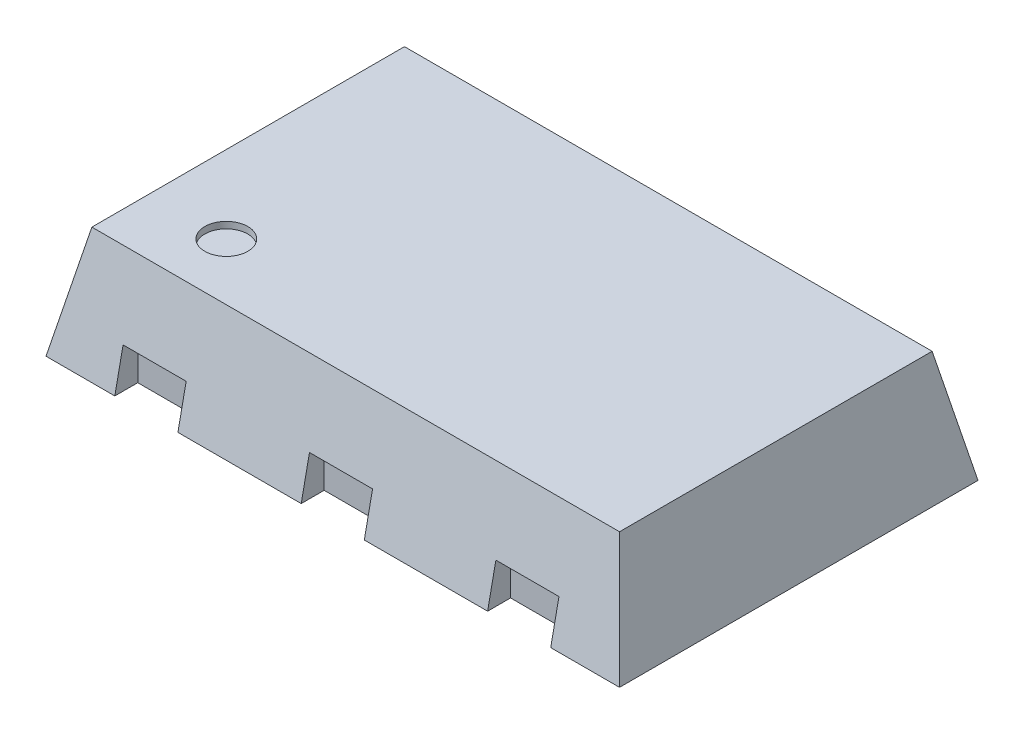
ISO-10303-21;
HEADER;
FILE_DESCRIPTION(('STEP AP214'),'2;1');
FILE_NAME('part.step','',(''),(''),'','','');
FILE_SCHEMA(('AUTOMOTIVE_DESIGN { 1 0 10303 214 1 1 1 1 }'));
ENDSEC;
DATA;
#1=APPLICATION_CONTEXT('core data for automotive mechanical design processes');
#2=APPLICATION_PROTOCOL_DEFINITION('international standard','automotive_design',2000,#1);
#3=PRODUCT_CONTEXT('',#1,'mechanical');
#4=PRODUCT('Part','Part','',(#3));
#5=PRODUCT_RELATED_PRODUCT_CATEGORY('part','',(#4));
#6=PRODUCT_DEFINITION_FORMATION('','',#4);
#7=PRODUCT_DEFINITION_CONTEXT('part definition',#1,'design');
#8=PRODUCT_DEFINITION('design','',#6,#7);
#9=PRODUCT_DEFINITION_SHAPE('','',#8);
#10=(LENGTH_UNIT() NAMED_UNIT(*) SI_UNIT(.MILLI.,.METRE.));
#11=(NAMED_UNIT(*) PLANE_ANGLE_UNIT() SI_UNIT($,.RADIAN.));
#12=(NAMED_UNIT(*) SI_UNIT($,.STERADIAN.) SOLID_ANGLE_UNIT());
#13=UNCERTAINTY_MEASURE_WITH_UNIT(LENGTH_MEASURE(1.E-05),#10,'distance_accuracy_value','');
#14=(GEOMETRIC_REPRESENTATION_CONTEXT(3) GLOBAL_UNCERTAINTY_ASSIGNED_CONTEXT((#13)) GLOBAL_UNIT_ASSIGNED_CONTEXT((#10,
#11,#12)) REPRESENTATION_CONTEXT('',''));
#15=CARTESIAN_POINT('',(0.,0.,0.));
#16=DIRECTION('',(0.,0.,1.));
#17=DIRECTION('',(1.,0.,0.));
#18=AXIS2_PLACEMENT_3D('',#15,#16,#17);
#19=CARTESIAN_POINT('',(0.,0.09500000000001,0.));
#20=DIRECTION('',(0.,1.,0.));
#21=DIRECTION('',(0.,0.,-1.));
#22=AXIS2_PLACEMENT_3D('',#19,#20,#21);
#23=PLANE('',#22);
#24=DIRECTION('',(-1.,0.,0.));
#25=VECTOR('',#24,1.);
#26=CARTESIAN_POINT('',(0.,0.09500000000001,-0.545));
#27=LINE('',#26,#25);
#28=CARTESIAN_POINT('',(0.76,0.095,-0.545));
#29=VERTEX_POINT('',#28);
#30=CARTESIAN_POINT('',(0.54,0.095,-0.545));
#31=VERTEX_POINT('',#30);
#32=EDGE_CURVE('E314',#29,#31,#27,.T.);
#33=ORIENTED_EDGE('',*,*,#32,.F.);
#34=DIRECTION('',(0.,0.,1.));
#35=VECTOR('',#34,1.);
#36=CARTESIAN_POINT('',(0.76,0.09500000000001,0.));
#37=LINE('',#36,#35);
#38=CARTESIAN_POINT('',(0.76,0.095,-0.625));
#39=VERTEX_POINT('',#38);
#40=EDGE_CURVE('E501',#39,#29,#37,.T.);
#41=ORIENTED_EDGE('',*,*,#40,.F.);
#42=DIRECTION('',(-1.,0.,0.));
#43=VECTOR('',#42,1.);
#44=CARTESIAN_POINT('',(0.,0.09500000000001,-0.625));
#45=LINE('',#44,#43);
#46=CARTESIAN_POINT('',(1.,0.09500000000001,-0.625));
#47=VERTEX_POINT('',#46);
#48=EDGE_CURVE('E332',#47,#39,#45,.T.);
#49=ORIENTED_EDGE('',*,*,#48,.F.);
#50=DIRECTION('',(0.,0.,-1.));
#51=VECTOR('',#50,1.);
#52=CARTESIAN_POINT('',(1.,0.09500000000001,0.));
#53=LINE('',#52,#51);
#54=CARTESIAN_POINT('',(1.,0.09500000000001,0.625));
#55=VERTEX_POINT('',#54);
#56=EDGE_CURVE('E291',#55,#47,#53,.T.);
#57=ORIENTED_EDGE('',*,*,#56,.F.);
#58=DIRECTION('',(-1.,0.,0.));
#59=VECTOR('',#58,1.);
#60=CARTESIAN_POINT('',(0.,0.09500000000001,0.625));
#61=LINE('',#60,#59);
#62=CARTESIAN_POINT('',(0.76,0.095,0.625));
#63=VERTEX_POINT('',#62);
#64=EDGE_CURVE('E319',#55,#63,#61,.T.);
#65=ORIENTED_EDGE('',*,*,#64,.T.);
#66=DIRECTION('',(0.,0.,1.));
#67=VECTOR('',#66,1.);
#68=CARTESIAN_POINT('',(0.76,0.09500000000001,0.));
#69=LINE('',#68,#67);
#70=CARTESIAN_POINT('',(0.76,0.095,0.545));
#71=VERTEX_POINT('',#70);
#72=EDGE_CURVE('E305',#71,#63,#69,.T.);
#73=ORIENTED_EDGE('',*,*,#72,.F.);
#74=DIRECTION('',(1.,0.,0.));
#75=VECTOR('',#74,1.);
#76=CARTESIAN_POINT('',(0.,0.09500000000001,0.545));
#77=LINE('',#76,#75);
#78=CARTESIAN_POINT('',(0.54,0.095,0.545));
#79=VERTEX_POINT('',#78);
#80=EDGE_CURVE('E419',#79,#71,#77,.T.);
#81=ORIENTED_EDGE('',*,*,#80,.F.);
#82=DIRECTION('',(0.,0.,-1.));
#83=VECTOR('',#82,1.);
#84=CARTESIAN_POINT('',(0.54,0.09500000000001,0.));
#85=LINE('',#84,#83);
#86=CARTESIAN_POINT('',(0.54,0.09500000000001,0.625));
#87=VERTEX_POINT('',#86);
#88=EDGE_CURVE('E325',#87,#79,#85,.T.);
#89=ORIENTED_EDGE('',*,*,#88,.F.);
#90=DIRECTION('',(-1.,0.,0.));
#91=VECTOR('',#90,1.);
#92=CARTESIAN_POINT('',(0.,0.09500000000001,0.625));
#93=LINE('',#92,#91);
#94=CARTESIAN_POINT('',(0.11,0.095,0.625));
#95=VERTEX_POINT('',#94);
#96=EDGE_CURVE('E285',#87,#95,#93,.T.);
#97=ORIENTED_EDGE('',*,*,#96,.T.);
#98=DIRECTION('',(0.,0.,1.));
#99=VECTOR('',#98,1.);
#100=CARTESIAN_POINT('',(0.11,0.09500000000001,0.));
#101=LINE('',#100,#99);
#102=CARTESIAN_POINT('',(0.11,0.095,0.545));
#103=VERTEX_POINT('',#102);
#104=EDGE_CURVE('E329',#103,#95,#101,.T.);
#105=ORIENTED_EDGE('',*,*,#104,.F.);
#106=DIRECTION('',(1.,0.,0.));
#107=VECTOR('',#106,1.);
#108=CARTESIAN_POINT('',(0.,0.09500000000001,0.545));
#109=LINE('',#108,#107);
#110=CARTESIAN_POINT('',(-0.11,0.095,0.545));
#111=VERTEX_POINT('',#110);
#112=EDGE_CURVE('E341',#111,#103,#109,.T.);
#113=ORIENTED_EDGE('',*,*,#112,.F.);
#114=DIRECTION('',(0.,0.,-1.));
#115=VECTOR('',#114,1.);
#116=CARTESIAN_POINT('',(-0.11,0.09500000000001,0.));
#117=LINE('',#116,#115);
#118=CARTESIAN_POINT('',(-0.11,0.09500000000001,0.625));
#119=VERTEX_POINT('',#118);
#120=EDGE_CURVE('E451',#119,#111,#117,.T.);
#121=ORIENTED_EDGE('',*,*,#120,.F.);
#122=DIRECTION('',(-1.,0.,0.));
#123=VECTOR('',#122,1.);
#124=CARTESIAN_POINT('',(0.,0.09500000000001,0.625));
#125=LINE('',#124,#123);
#126=CARTESIAN_POINT('',(-0.54,0.095,0.625));
#127=VERTEX_POINT('',#126);
#128=EDGE_CURVE('E381',#119,#127,#125,.T.);
#129=ORIENTED_EDGE('',*,*,#128,.T.);
#130=DIRECTION('',(0.,0.,1.));
#131=VECTOR('',#130,1.);
#132=CARTESIAN_POINT('',(-0.54,0.09500000000001,0.));
#133=LINE('',#132,#131);
#134=CARTESIAN_POINT('',(-0.54,0.095,0.545));
#135=VERTEX_POINT('',#134);
#136=EDGE_CURVE('E455',#135,#127,#133,.T.);
#137=ORIENTED_EDGE('',*,*,#136,.F.);
#138=DIRECTION('',(1.,0.,0.));
#139=VECTOR('',#138,1.);
#140=CARTESIAN_POINT('',(0.,0.09500000000001,0.545));
#141=LINE('',#140,#139);
#142=CARTESIAN_POINT('',(-0.76,0.095,0.545));
#143=VERTEX_POINT('',#142);
#144=EDGE_CURVE('E202',#143,#135,#141,.T.);
#145=ORIENTED_EDGE('',*,*,#144,.F.);
#146=DIRECTION('',(0.,0.,-1.));
#147=VECTOR('',#146,1.);
#148=CARTESIAN_POINT('',(-0.76,0.09500000000001,0.));
#149=LINE('',#148,#147);
#150=CARTESIAN_POINT('',(-0.76,0.09500000000001,0.625));
#151=VERTEX_POINT('',#150);
#152=EDGE_CURVE('E259',#151,#143,#149,.T.);
#153=ORIENTED_EDGE('',*,*,#152,.F.);
#154=DIRECTION('',(-1.,0.,0.));
#155=VECTOR('',#154,1.);
#156=CARTESIAN_POINT('',(0.,0.09500000000001,0.625));
#157=LINE('',#156,#155);
#158=CARTESIAN_POINT('',(-1.,0.09500000000001,0.625));
#159=VERTEX_POINT('',#158);
#160=EDGE_CURVE('E347',#151,#159,#157,.T.);
#161=ORIENTED_EDGE('',*,*,#160,.T.);
#162=DIRECTION('',(0.,0.,1.));
#163=VECTOR('',#162,1.);
#164=CARTESIAN_POINT('',(-1.,0.09500000000001,0.));
#165=LINE('',#164,#163);
#166=CARTESIAN_POINT('',(-1.,0.09500000000001,-0.625));
#167=VERTEX_POINT('',#166);
#168=EDGE_CURVE('E407',#167,#159,#165,.T.);
#169=ORIENTED_EDGE('',*,*,#168,.F.);
#170=DIRECTION('',(-1.,0.,0.));
#171=VECTOR('',#170,1.);
#172=CARTESIAN_POINT('',(0.,0.09500000000001,-0.625));
#173=LINE('',#172,#171);
#174=CARTESIAN_POINT('',(-0.76,0.095,-0.625));
#175=VERTEX_POINT('',#174);
#176=EDGE_CURVE('E214',#175,#167,#173,.T.);
#177=ORIENTED_EDGE('',*,*,#176,.F.);
#178=DIRECTION('',(0.,0.,-1.));
#179=VECTOR('',#178,1.);
#180=CARTESIAN_POINT('',(-0.76,0.09500000000001,0.));
#181=LINE('',#180,#179);
#182=CARTESIAN_POINT('',(-0.76,0.095,-0.545));
#183=VERTEX_POINT('',#182);
#184=EDGE_CURVE('E368',#183,#175,#181,.T.);
#185=ORIENTED_EDGE('',*,*,#184,.F.);
#186=DIRECTION('',(-1.,0.,0.));
#187=VECTOR('',#186,1.);
#188=CARTESIAN_POINT('',(0.,0.09500000000001,-0.545));
#189=LINE('',#188,#187);
#190=CARTESIAN_POINT('',(-0.54,0.095,-0.545));
#191=VERTEX_POINT('',#190);
#192=EDGE_CURVE('E373',#191,#183,#189,.T.);
#193=ORIENTED_EDGE('',*,*,#192,.F.);
#194=DIRECTION('',(0.,0.,1.));
#195=VECTOR('',#194,1.);
#196=CARTESIAN_POINT('',(-0.54,0.09500000000001,0.));
#197=LINE('',#196,#195);
#198=CARTESIAN_POINT('',(-0.54,0.095,-0.625));
#199=VERTEX_POINT('',#198);
#200=EDGE_CURVE('E309',#199,#191,#197,.T.);
#201=ORIENTED_EDGE('',*,*,#200,.F.);
#202=DIRECTION('',(-1.,0.,0.));
#203=VECTOR('',#202,1.);
#204=CARTESIAN_POINT('',(0.,0.09500000000001,-0.625));
#205=LINE('',#204,#203);
#206=CARTESIAN_POINT('',(0.54,0.095,-0.625));
#207=VERTEX_POINT('',#206);
#208=EDGE_CURVE('E295',#207,#199,#205,.T.);
#209=ORIENTED_EDGE('',*,*,#208,.F.);
#210=DIRECTION('',(0.,0.,-1.));
#211=VECTOR('',#210,1.);
#212=CARTESIAN_POINT('',(0.54,0.09500000000001,0.));
#213=LINE('',#212,#211);
#214=EDGE_CURVE('E11',#31,#207,#213,.T.);
#215=ORIENTED_EDGE('',*,*,#214,.F.);
#216=EDGE_LOOP('',(#33,#41,#49,#57,#65,#73,#81,#89,#97,#105,#113,#121,#129,#137,#145,#153,#161,
#169,#177,#185,#193,#201,#209,#215));
#217=FACE_BOUND('',#216,.T.);
#218=ADVANCED_FACE('F16',(#217),#23,.F.);
#219=CARTESIAN_POINT('',(0.54,-0.121132572617,-0.825365755119));
#220=DIRECTION('',(1.,0.,0.));
#221=DIRECTION('',(0.,-1.,0.));
#222=AXIS2_PLACEMENT_3D('',#219,#220,#221);
#223=PLANE('',#222);
#224=DIRECTION('',(0.,-1.,0.));
#225=VECTOR('',#224,1.);
#226=CARTESIAN_POINT('',(0.54,-0.121132572617,-0.545));
#227=LINE('',#226,#225);
#228=CARTESIAN_POINT('',(0.54,0.235,-0.545));
#229=VERTEX_POINT('',#228);
#230=EDGE_CURVE('E27',#229,#31,#227,.T.);
#231=ORIENTED_EDGE('',*,*,#230,.T.);
#232=ORIENTED_EDGE('',*,*,#214,.T.);
#233=DIRECTION('',(0.,0.979602700641535,0.20094414372111));
#234=VECTOR('',#233,1.);
#235=CARTESIAN_POINT('',(0.54,0.095,-0.625));
#236=LINE('',#235,#234);
#237=CARTESIAN_POINT('',(0.54,0.235,-0.596282051282));
#238=VERTEX_POINT('',#237);
#239=EDGE_CURVE('E505',#207,#238,#236,.T.);
#240=ORIENTED_EDGE('',*,*,#239,.T.);
#241=DIRECTION('',(0.,0.,1.));
#242=VECTOR('',#241,1.);
#243=CARTESIAN_POINT('',(0.54,0.235,-0.825365755119));
#244=LINE('',#243,#242);
#245=EDGE_CURVE('E310',#238,#229,#244,.T.);
#246=ORIENTED_EDGE('',*,*,#245,.T.);
#247=EDGE_LOOP('',(#231,#232,#240,#246));
#248=FACE_BOUND('',#247,.T.);
#249=ADVANCED_FACE('F860',(#248),#223,.T.);
#250=CARTESIAN_POINT('',(0.54,0.095,-0.545));
#251=DIRECTION('',(0.,0.,1.));
#252=DIRECTION('',(0.,-1.,0.));
#253=AXIS2_PLACEMENT_3D('',#250,#251,#252);
#254=PLANE('',#253);
#255=ORIENTED_EDGE('',*,*,#32,.T.);
#256=ORIENTED_EDGE('',*,*,#230,.F.);
#257=DIRECTION('',(-1.,0.,0.));
#258=VECTOR('',#257,1.);
#259=CARTESIAN_POINT('',(0.54,0.235,-0.545));
#260=LINE('',#259,#258);
#261=CARTESIAN_POINT('',(0.76,0.235,-0.545));
#262=VERTEX_POINT('',#261);
#263=EDGE_CURVE('E360',#262,#229,#260,.T.);
#264=ORIENTED_EDGE('',*,*,#263,.F.);
#265=DIRECTION('',(0.,1.,0.));
#266=VECTOR('',#265,1.);
#267=CARTESIAN_POINT('',(0.76,0.095,-0.545));
#268=LINE('',#267,#266);
#269=EDGE_CURVE('E318',#29,#262,#268,.T.);
#270=ORIENTED_EDGE('',*,*,#269,.F.);
#271=EDGE_LOOP('',(#255,#256,#264,#270));
#272=FACE_BOUND('',#271,.T.);
#273=ADVANCED_FACE('F865',(#272),#254,.F.);
#274=CARTESIAN_POINT('',(0.76,0.165,-0.545));
#275=DIRECTION('',(1.,0.,0.));
#276=DIRECTION('',(0.,1.,0.));
#277=AXIS2_PLACEMENT_3D('',#274,#275,#276);
#278=PLANE('',#277);
#279=ORIENTED_EDGE('',*,*,#40,.T.);
#280=ORIENTED_EDGE('',*,*,#269,.T.);
#281=DIRECTION('',(0.,0.,1.));
#282=VECTOR('',#281,1.);
#283=CARTESIAN_POINT('',(0.76,0.235,-0.545));
#284=LINE('',#283,#282);
#285=CARTESIAN_POINT('',(0.76,0.235,-0.596282051282));
#286=VERTEX_POINT('',#285);
#287=EDGE_CURVE('E364',#286,#262,#284,.T.);
#288=ORIENTED_EDGE('',*,*,#287,.F.);
#289=DIRECTION('',(0.,0.979602700641535,0.20094414372111));
#290=VECTOR('',#289,1.);
#291=CARTESIAN_POINT('',(0.76,0.095,-0.625));
#292=LINE('',#291,#290);
#293=EDGE_CURVE('E235',#39,#286,#292,.T.);
#294=ORIENTED_EDGE('',*,*,#293,.F.);
#295=EDGE_LOOP('',(#279,#280,#288,#294));
#296=FACE_BOUND('',#295,.T.);
#297=ADVANCED_FACE('F557',(#296),#278,.F.);
#298=CARTESIAN_POINT('',(0.,0.29,-0.585));
#299=DIRECTION('',(0.,-0.20094414372111,0.979602700641535));
#300=DIRECTION('',(-1.,0.,0.));
#301=AXIS2_PLACEMENT_3D('',#298,#299,#300);
#302=PLANE('',#301);
#303=ORIENTED_EDGE('',*,*,#208,.T.);
#304=DIRECTION('',(0.,-0.979602700641535,-0.20094414372111));
#305=VECTOR('',#304,1.);
#306=CARTESIAN_POINT('',(-0.54,0.29,-0.585));
#307=LINE('',#306,#305);
#308=CARTESIAN_POINT('',(-0.54,0.235,-0.596282051282));
#309=VERTEX_POINT('',#308);
#310=EDGE_CURVE('E369',#309,#199,#307,.T.);
#311=ORIENTED_EDGE('',*,*,#310,.F.);
#312=DIRECTION('',(1.,0.,0.));
#313=VECTOR('',#312,1.);
#314=CARTESIAN_POINT('',(0.,0.235,-0.596282051282));
#315=LINE('',#314,#313);
#316=CARTESIAN_POINT('',(-0.76,0.235,-0.596282051282));
#317=VERTEX_POINT('',#316);
#318=EDGE_CURVE('E466',#317,#309,#315,.T.);
#319=ORIENTED_EDGE('',*,*,#318,.F.);
#320=DIRECTION('',(0.,0.979602700641535,0.20094414372111));
#321=VECTOR('',#320,1.);
#322=CARTESIAN_POINT('',(-0.76,0.29,-0.585));
#323=LINE('',#322,#321);
#324=EDGE_CURVE('E226',#175,#317,#323,.T.);
#325=ORIENTED_EDGE('',*,*,#324,.F.);
#326=ORIENTED_EDGE('',*,*,#176,.T.);
#327=DIRECTION('',(-0.197006093430975,-0.96040470547688,-0.197006093430975));
#328=VECTOR('',#327,1.);
#329=CARTESIAN_POINT('',(-0.92,0.485,-0.545));
#330=LINE('',#329,#328);
#331=CARTESIAN_POINT('',(-0.92,0.485,-0.545));
#332=VERTEX_POINT('',#331);
#333=EDGE_CURVE('E367',#332,#167,#330,.T.);
#334=ORIENTED_EDGE('',*,*,#333,.F.);
#335=DIRECTION('',(-1.,0.,0.));
#336=VECTOR('',#335,1.);
#337=CARTESIAN_POINT('',(0.,0.485,-0.545));
#338=LINE('',#337,#336);
#339=CARTESIAN_POINT('',(0.92,0.485,-0.545));
#340=VERTEX_POINT('',#339);
#341=EDGE_CURVE('E418',#340,#332,#338,.T.);
#342=ORIENTED_EDGE('',*,*,#341,.F.);
#343=DIRECTION('',(-0.197006093430975,0.96040470547688,0.197006093430975));
#344=VECTOR('',#343,1.);
#345=CARTESIAN_POINT('',(1.,0.09500000000001,-0.625));
#346=LINE('',#345,#344);
#347=EDGE_CURVE('E296',#47,#340,#346,.T.);
#348=ORIENTED_EDGE('',*,*,#347,.F.);
#349=ORIENTED_EDGE('',*,*,#48,.T.);
#350=ORIENTED_EDGE('',*,*,#293,.T.);
#351=DIRECTION('',(1.,0.,0.));
#352=VECTOR('',#351,1.);
#353=CARTESIAN_POINT('',(0.,0.235,-0.596282051282));
#354=LINE('',#353,#352);
#355=EDGE_CURVE('E306',#238,#286,#354,.T.);
#356=ORIENTED_EDGE('',*,*,#355,.F.);
#357=ORIENTED_EDGE('',*,*,#239,.F.);
#358=EDGE_LOOP('',(#303,#311,#319,#325,#326,#334,#342,#348,#349,#350,#356,#357));
#359=FACE_BOUND('',#358,.T.);
#360=ADVANCED_FACE('F545',(#359),#302,.F.);
#361=CARTESIAN_POINT('',(0.96,0.29,0.));
#362=DIRECTION('',(-0.979602700641535,-0.20094414372111,0.));
#363=DIRECTION('',(-0.20094414372111,0.979602700641535,0.));
#364=AXIS2_PLACEMENT_3D('',#361,#362,#363);
#365=PLANE('',#364);
#366=ORIENTED_EDGE('',*,*,#347,.T.);
#367=DIRECTION('',(0.,0.,-1.));
#368=VECTOR('',#367,1.);
#369=CARTESIAN_POINT('',(0.92,0.485,0.));
#370=LINE('',#369,#368);
#371=CARTESIAN_POINT('',(0.92,0.485,0.545));
#372=VERTEX_POINT('',#371);
#373=EDGE_CURVE('E434',#372,#340,#370,.T.);
#374=ORIENTED_EDGE('',*,*,#373,.F.);
#375=DIRECTION('',(0.197006093430975,-0.96040470547688,0.197006093430975));
#376=VECTOR('',#375,1.);
#377=CARTESIAN_POINT('',(0.92,0.485,0.545));
#378=LINE('',#377,#376);
#379=EDGE_CURVE('E323',#372,#55,#378,.T.);
#380=ORIENTED_EDGE('',*,*,#379,.T.);
#381=ORIENTED_EDGE('',*,*,#56,.T.);
#382=EDGE_LOOP('',(#366,#374,#380,#381));
#383=FACE_BOUND('',#382,.T.);
#384=ADVANCED_FACE('F551',(#383),#365,.F.);
#385=CARTESIAN_POINT('',(0.76,0.165,0.545));
#386=DIRECTION('',(-1.,0.,0.));
#387=DIRECTION('',(0.,0.,1.));
#388=AXIS2_PLACEMENT_3D('',#385,#386,#387);
#389=PLANE('',#388);
#390=DIRECTION('',(0.,-1.,0.));
#391=VECTOR('',#390,1.);
#392=CARTESIAN_POINT('',(0.76,0.165,0.545));
#393=LINE('',#392,#391);
#394=CARTESIAN_POINT('',(0.76,0.235,0.545));
#395=VERTEX_POINT('',#394);
#396=EDGE_CURVE('E403',#395,#71,#393,.T.);
#397=ORIENTED_EDGE('',*,*,#396,.T.);
#398=ORIENTED_EDGE('',*,*,#72,.T.);
#399=DIRECTION('',(0.,0.979602700641535,-0.20094414372111));
#400=VECTOR('',#399,1.);
#401=CARTESIAN_POINT('',(0.76,0.29,0.585));
#402=LINE('',#401,#400);
#403=CARTESIAN_POINT('',(0.76,0.235,0.596282051282));
#404=VERTEX_POINT('',#403);
#405=EDGE_CURVE('E324',#63,#404,#402,.T.);
#406=ORIENTED_EDGE('',*,*,#405,.T.);
#407=DIRECTION('',(0.,0.,-1.));
#408=VECTOR('',#407,1.);
#409=CARTESIAN_POINT('',(0.76,0.235,0.545));
#410=LINE('',#409,#408);
#411=EDGE_CURVE('E301',#404,#395,#410,.T.);
#412=ORIENTED_EDGE('',*,*,#411,.T.);
#413=EDGE_LOOP('',(#397,#398,#406,#412));
#414=FACE_BOUND('',#413,.T.);
#415=ADVANCED_FACE('F847',(#414),#389,.T.);
#416=CARTESIAN_POINT('',(0.54,0.235,0.545));
#417=DIRECTION('',(0.,0.,-1.));
#418=DIRECTION('',(-1.,0.,0.));
#419=AXIS2_PLACEMENT_3D('',#416,#417,#418);
#420=PLANE('',#419);
#421=DIRECTION('',(1.,0.,0.));
#422=VECTOR('',#421,1.);
#423=CARTESIAN_POINT('',(0.54,0.235,0.545));
#424=LINE('',#423,#422);
#425=CARTESIAN_POINT('',(0.54,0.235,0.545));
#426=VERTEX_POINT('',#425);
#427=EDGE_CURVE('E297',#426,#395,#424,.T.);
#428=ORIENTED_EDGE('',*,*,#427,.F.);
#429=DIRECTION('',(0.,1.,0.));
#430=VECTOR('',#429,1.);
#431=CARTESIAN_POINT('',(0.54,0.235,0.545));
#432=LINE('',#431,#430);
#433=EDGE_CURVE('E289',#79,#426,#432,.T.);
#434=ORIENTED_EDGE('',*,*,#433,.F.);
#435=ORIENTED_EDGE('',*,*,#80,.T.);
#436=ORIENTED_EDGE('',*,*,#396,.F.);
#437=EDGE_LOOP('',(#428,#434,#435,#436));
#438=FACE_BOUND('',#437,.T.);
#439=ADVANCED_FACE('F838',(#438),#420,.F.);
#440=CARTESIAN_POINT('',(0.54,-0.121132572617,0.825365755119));
#441=DIRECTION('',(-1.,0.,0.));
#442=DIRECTION('',(0.,0.,1.));
#443=AXIS2_PLACEMENT_3D('',#440,#441,#442);
#444=PLANE('',#443);
#445=ORIENTED_EDGE('',*,*,#88,.T.);
#446=ORIENTED_EDGE('',*,*,#433,.T.);
#447=DIRECTION('',(0.,0.,-1.));
#448=VECTOR('',#447,1.);
#449=CARTESIAN_POINT('',(0.54,0.235,0.825365755119));
#450=LINE('',#449,#448);
#451=CARTESIAN_POINT('',(0.54,0.235,0.596282051282));
#452=VERTEX_POINT('',#451);
#453=EDGE_CURVE('E302',#452,#426,#450,.T.);
#454=ORIENTED_EDGE('',*,*,#453,.F.);
#455=DIRECTION('',(0.,-0.979602700641535,0.20094414372111));
#456=VECTOR('',#455,1.);
#457=CARTESIAN_POINT('',(0.54,0.29,0.585));
#458=LINE('',#457,#456);
#459=EDGE_CURVE('E278',#452,#87,#458,.T.);
#460=ORIENTED_EDGE('',*,*,#459,.T.);
#461=EDGE_LOOP('',(#445,#446,#454,#460));
#462=FACE_BOUND('',#461,.T.);
#463=ADVANCED_FACE('F835',(#462),#444,.F.);
#464=CARTESIAN_POINT('',(0.11,0.165,0.545));
#465=DIRECTION('',(-1.,0.,0.));
#466=DIRECTION('',(0.,0.,1.));
#467=AXIS2_PLACEMENT_3D('',#464,#465,#466);
#468=PLANE('',#467);
#469=DIRECTION('',(0.,-1.,0.));
#470=VECTOR('',#469,1.);
#471=CARTESIAN_POINT('',(0.11,0.165,0.545));
#472=LINE('',#471,#470);
#473=CARTESIAN_POINT('',(0.11,0.235,0.545));
#474=VERTEX_POINT('',#473);
#475=EDGE_CURVE('E345',#474,#103,#472,.T.);
#476=ORIENTED_EDGE('',*,*,#475,.T.);
#477=ORIENTED_EDGE('',*,*,#104,.T.);
#478=DIRECTION('',(0.,0.979602700641535,-0.20094414372111));
#479=VECTOR('',#478,1.);
#480=CARTESIAN_POINT('',(0.11,0.29,0.585));
#481=LINE('',#480,#479);
#482=CARTESIAN_POINT('',(0.11,0.235,0.596282051282));
#483=VERTEX_POINT('',#482);
#484=EDGE_CURVE('E396',#95,#483,#481,.T.);
#485=ORIENTED_EDGE('',*,*,#484,.T.);
#486=DIRECTION('',(0.,0.,-1.));
#487=VECTOR('',#486,1.);
#488=CARTESIAN_POINT('',(0.11,0.235,0.545));
#489=LINE('',#488,#487);
#490=EDGE_CURVE('E355',#483,#474,#489,.T.);
#491=ORIENTED_EDGE('',*,*,#490,.T.);
#492=EDGE_LOOP('',(#476,#477,#485,#491));
#493=FACE_BOUND('',#492,.T.);
#494=ADVANCED_FACE('F900',(#493),#468,.T.);
#495=CARTESIAN_POINT('',(-0.11,0.235,0.545));
#496=DIRECTION('',(0.,0.,-1.));
#497=DIRECTION('',(-1.,0.,0.));
#498=AXIS2_PLACEMENT_3D('',#495,#496,#497);
#499=PLANE('',#498);
#500=DIRECTION('',(1.,0.,0.));
#501=VECTOR('',#500,1.);
#502=CARTESIAN_POINT('',(-0.11,0.235,0.545));
#503=LINE('',#502,#501);
#504=CARTESIAN_POINT('',(-0.11,0.235,0.545));
#505=VERTEX_POINT('',#504);
#506=EDGE_CURVE('E359',#505,#474,#503,.T.);
#507=ORIENTED_EDGE('',*,*,#506,.F.);
#508=DIRECTION('',(0.,1.,0.));
#509=VECTOR('',#508,1.);
#510=CARTESIAN_POINT('',(-0.11,0.235,0.545));
#511=LINE('',#510,#509);
#512=EDGE_CURVE('E346',#111,#505,#511,.T.);
#513=ORIENTED_EDGE('',*,*,#512,.F.);
#514=ORIENTED_EDGE('',*,*,#112,.T.);
#515=ORIENTED_EDGE('',*,*,#475,.F.);
#516=EDGE_LOOP('',(#507,#513,#514,#515));
#517=FACE_BOUND('',#516,.T.);
#518=ADVANCED_FACE('F897',(#517),#499,.F.);
#519=CARTESIAN_POINT('',(-0.11,-0.121132572617,0.825365755119));
#520=DIRECTION('',(-1.,0.,0.));
#521=DIRECTION('',(0.,0.,1.));
#522=AXIS2_PLACEMENT_3D('',#519,#520,#521);
#523=PLANE('',#522);
#524=ORIENTED_EDGE('',*,*,#120,.T.);
#525=ORIENTED_EDGE('',*,*,#512,.T.);
#526=DIRECTION('',(0.,0.,-1.));
#527=VECTOR('',#526,1.);
#528=CARTESIAN_POINT('',(-0.11,0.235,0.825365755119));
#529=LINE('',#528,#527);
#530=CARTESIAN_POINT('',(-0.11,0.235,0.596282051282));
#531=VERTEX_POINT('',#530);
#532=EDGE_CURVE('E313',#531,#505,#529,.T.);
#533=ORIENTED_EDGE('',*,*,#532,.F.);
#534=DIRECTION('',(0.,-0.979602700641535,0.20094414372111));
#535=VECTOR('',#534,1.);
#536=CARTESIAN_POINT('',(-0.11,0.29,0.585));
#537=LINE('',#536,#535);
#538=EDGE_CURVE('E385',#531,#119,#537,.T.);
#539=ORIENTED_EDGE('',*,*,#538,.T.);
#540=EDGE_LOOP('',(#524,#525,#533,#539));
#541=FACE_BOUND('',#540,.T.);
#542=ADVANCED_FACE('F899',(#541),#523,.F.);
#543=CARTESIAN_POINT('',(-0.54,0.165,0.545));
#544=DIRECTION('',(-1.,0.,0.));
#545=DIRECTION('',(0.,0.,1.));
#546=AXIS2_PLACEMENT_3D('',#543,#544,#545);
#547=PLANE('',#546);
#548=DIRECTION('',(0.,-1.,0.));
#549=VECTOR('',#548,1.);
#550=CARTESIAN_POINT('',(-0.54,0.165,0.545));
#551=LINE('',#550,#549);
#552=CARTESIAN_POINT('',(-0.54,0.235,0.545));
#553=VERTEX_POINT('',#552);
#554=EDGE_CURVE('E267',#553,#135,#551,.T.);
#555=ORIENTED_EDGE('',*,*,#554,.T.);
#556=ORIENTED_EDGE('',*,*,#136,.T.);
#557=DIRECTION('',(0.,0.979602700641535,-0.20094414372111));
#558=VECTOR('',#557,1.);
#559=CARTESIAN_POINT('',(-0.54,0.29,0.585));
#560=LINE('',#559,#558);
#561=CARTESIAN_POINT('',(-0.54,0.235,0.596282051282));
#562=VERTEX_POINT('',#561);
#563=EDGE_CURVE('E386',#127,#562,#560,.T.);
#564=ORIENTED_EDGE('',*,*,#563,.T.);
#565=DIRECTION('',(0.,0.,-1.));
#566=VECTOR('',#565,1.);
#567=CARTESIAN_POINT('',(-0.54,0.235,0.545));
#568=LINE('',#567,#566);
#569=EDGE_CURVE('E271',#562,#553,#568,.T.);
#570=ORIENTED_EDGE('',*,*,#569,.T.);
#571=EDGE_LOOP('',(#555,#556,#564,#570));
#572=FACE_BOUND('',#571,.T.);
#573=ADVANCED_FACE('F533',(#572),#547,.T.);
#574=CARTESIAN_POINT('',(-0.76,0.235,0.545));
#575=DIRECTION('',(0.,0.,-1.));
#576=DIRECTION('',(-1.,0.,0.));
#577=AXIS2_PLACEMENT_3D('',#574,#575,#576);
#578=PLANE('',#577);
#579=DIRECTION('',(1.,0.,0.));
#580=VECTOR('',#579,1.);
#581=CARTESIAN_POINT('',(-0.76,0.235,0.545));
#582=LINE('',#581,#580);
#583=CARTESIAN_POINT('',(-0.76,0.235,0.545));
#584=VERTEX_POINT('',#583);
#585=EDGE_CURVE('E264',#584,#553,#582,.T.);
#586=ORIENTED_EDGE('',*,*,#585,.F.);
#587=DIRECTION('',(0.,1.,0.));
#588=VECTOR('',#587,1.);
#589=CARTESIAN_POINT('',(-0.76,0.235,0.545));
#590=LINE('',#589,#588);
#591=EDGE_CURVE('E252',#143,#584,#590,.T.);
#592=ORIENTED_EDGE('',*,*,#591,.F.);
#593=ORIENTED_EDGE('',*,*,#144,.T.);
#594=ORIENTED_EDGE('',*,*,#554,.F.);
#595=EDGE_LOOP('',(#586,#592,#593,#594));
#596=FACE_BOUND('',#595,.T.);
#597=ADVANCED_FACE('F265',(#596),#578,.F.);
#598=CARTESIAN_POINT('',(-0.76,-0.121132572617,0.825365755119));
#599=DIRECTION('',(-1.,0.,0.));
#600=DIRECTION('',(0.,0.,1.));
#601=AXIS2_PLACEMENT_3D('',#598,#599,#600);
#602=PLANE('',#601);
#603=ORIENTED_EDGE('',*,*,#152,.T.);
#604=ORIENTED_EDGE('',*,*,#591,.T.);
#605=DIRECTION('',(0.,0.,-1.));
#606=VECTOR('',#605,1.);
#607=CARTESIAN_POINT('',(-0.76,0.235,0.825365755119));
#608=LINE('',#607,#606);
#609=CARTESIAN_POINT('',(-0.76,0.235,0.596282051282));
#610=VERTEX_POINT('',#609);
#611=EDGE_CURVE('E257',#610,#584,#608,.T.);
#612=ORIENTED_EDGE('',*,*,#611,.F.);
#613=DIRECTION('',(0.,-0.979602700641535,0.20094414372111));
#614=VECTOR('',#613,1.);
#615=CARTESIAN_POINT('',(-0.76,0.29,0.585));
#616=LINE('',#615,#614);
#617=EDGE_CURVE('E351',#610,#151,#616,.T.);
#618=ORIENTED_EDGE('',*,*,#617,.T.);
#619=EDGE_LOOP('',(#603,#604,#612,#618));
#620=FACE_BOUND('',#619,.T.);
#621=ADVANCED_FACE('F254',(#620),#602,.F.);
#622=CARTESIAN_POINT('',(-0.96,0.29,0.));
#623=DIRECTION('',(0.979602700641535,-0.20094414372111,0.));
#624=DIRECTION('',(0.,0.,-1.));
#625=AXIS2_PLACEMENT_3D('',#622,#623,#624);
#626=PLANE('',#625);
#627=DIRECTION('',(0.197006093430975,0.96040470547688,-0.197006093430975));
#628=VECTOR('',#627,1.);
#629=CARTESIAN_POINT('',(-1.,0.09500000000001,0.625));
#630=LINE('',#629,#628);
#631=CARTESIAN_POINT('',(-0.92,0.485,0.545));
#632=VERTEX_POINT('',#631);
#633=EDGE_CURVE('E352',#159,#632,#630,.T.);
#634=ORIENTED_EDGE('',*,*,#633,.T.);
#635=DIRECTION('',(0.,0.,1.));
#636=VECTOR('',#635,1.);
#637=CARTESIAN_POINT('',(-0.92,0.485,0.));
#638=LINE('',#637,#636);
#639=EDGE_CURVE('E415',#332,#632,#638,.T.);
#640=ORIENTED_EDGE('',*,*,#639,.F.);
#641=ORIENTED_EDGE('',*,*,#333,.T.);
#642=ORIENTED_EDGE('',*,*,#168,.T.);
#643=EDGE_LOOP('',(#634,#640,#641,#642));
#644=FACE_BOUND('',#643,.T.);
#645=ADVANCED_FACE('F18',(#644),#626,.F.);
#646=CARTESIAN_POINT('',(-0.76,-0.121132572617,-0.825365755119));
#647=DIRECTION('',(1.,0.,0.));
#648=DIRECTION('',(0.,-1.,0.));
#649=AXIS2_PLACEMENT_3D('',#646,#647,#648);
#650=PLANE('',#649);
#651=DIRECTION('',(0.,-1.,0.));
#652=VECTOR('',#651,1.);
#653=CARTESIAN_POINT('',(-0.76,-0.121132572617,-0.545));
#654=LINE('',#653,#652);
#655=CARTESIAN_POINT('',(-0.76,0.235,-0.545));
#656=VERTEX_POINT('',#655);
#657=EDGE_CURVE('E400',#656,#183,#654,.T.);
#658=ORIENTED_EDGE('',*,*,#657,.T.);
#659=ORIENTED_EDGE('',*,*,#184,.T.);
#660=ORIENTED_EDGE('',*,*,#324,.T.);
#661=DIRECTION('',(0.,0.,1.));
#662=VECTOR('',#661,1.);
#663=CARTESIAN_POINT('',(-0.76,0.235,-0.825365755119));
#664=LINE('',#663,#662);
#665=EDGE_CURVE('E339',#317,#656,#664,.T.);
#666=ORIENTED_EDGE('',*,*,#665,.T.);
#667=EDGE_LOOP('',(#658,#659,#660,#666));
#668=FACE_BOUND('',#667,.T.);
#669=ADVANCED_FACE('F609',(#668),#650,.T.);
#670=CARTESIAN_POINT('',(-0.76,0.095,-0.545));
#671=DIRECTION('',(0.,0.,1.));
#672=DIRECTION('',(0.,-1.,0.));
#673=AXIS2_PLACEMENT_3D('',#670,#671,#672);
#674=PLANE('',#673);
#675=ORIENTED_EDGE('',*,*,#192,.T.);
#676=ORIENTED_EDGE('',*,*,#657,.F.);
#677=DIRECTION('',(-1.,0.,0.));
#678=VECTOR('',#677,1.);
#679=CARTESIAN_POINT('',(-0.76,0.235,-0.545));
#680=LINE('',#679,#678);
#681=CARTESIAN_POINT('',(-0.54,0.235,-0.545));
#682=VERTEX_POINT('',#681);
#683=EDGE_CURVE('E335',#682,#656,#680,.T.);
#684=ORIENTED_EDGE('',*,*,#683,.F.);
#685=DIRECTION('',(0.,1.,0.));
#686=VECTOR('',#685,1.);
#687=CARTESIAN_POINT('',(-0.54,0.095,-0.545));
#688=LINE('',#687,#686);
#689=EDGE_CURVE('E20',#191,#682,#688,.T.);
#690=ORIENTED_EDGE('',*,*,#689,.F.);
#691=EDGE_LOOP('',(#675,#676,#684,#690));
#692=FACE_BOUND('',#691,.T.);
#693=ADVANCED_FACE('F611',(#692),#674,.F.);
#694=CARTESIAN_POINT('',(-0.54,0.165,-0.545));
#695=DIRECTION('',(1.,0.,0.));
#696=DIRECTION('',(0.,1.,0.));
#697=AXIS2_PLACEMENT_3D('',#694,#695,#696);
#698=PLANE('',#697);
#699=ORIENTED_EDGE('',*,*,#200,.T.);
#700=ORIENTED_EDGE('',*,*,#689,.T.);
#701=DIRECTION('',(0.,0.,1.));
#702=VECTOR('',#701,1.);
#703=CARTESIAN_POINT('',(-0.54,0.235,-0.545));
#704=LINE('',#703,#702);
#705=EDGE_CURVE('E340',#309,#682,#704,.T.);
#706=ORIENTED_EDGE('',*,*,#705,.F.);
#707=ORIENTED_EDGE('',*,*,#310,.T.);
#708=EDGE_LOOP('',(#699,#700,#706,#707));
#709=FACE_BOUND('',#708,.T.);
#710=ADVANCED_FACE('F566',(#709),#698,.F.);
#711=CARTESIAN_POINT('',(0.54,0.235,-0.545));
#712=DIRECTION('',(0.,1.,0.));
#713=DIRECTION('',(1.,0.,0.));
#714=AXIS2_PLACEMENT_3D('',#711,#712,#713);
#715=PLANE('',#714);
#716=ORIENTED_EDGE('',*,*,#287,.T.);
#717=ORIENTED_EDGE('',*,*,#263,.T.);
#718=ORIENTED_EDGE('',*,*,#245,.F.);
#719=ORIENTED_EDGE('',*,*,#355,.T.);
#720=EDGE_LOOP('',(#716,#717,#718,#719));
#721=FACE_BOUND('',#720,.T.);
#722=ADVANCED_FACE('F560',(#721),#715,.F.);
#723=CARTESIAN_POINT('',(-0.76,0.235,-0.545));
#724=DIRECTION('',(0.,1.,0.));
#725=DIRECTION('',(1.,0.,0.));
#726=AXIS2_PLACEMENT_3D('',#723,#724,#725);
#727=PLANE('',#726);
#728=ORIENTED_EDGE('',*,*,#705,.T.);
#729=ORIENTED_EDGE('',*,*,#683,.T.);
#730=ORIENTED_EDGE('',*,*,#665,.F.);
#731=ORIENTED_EDGE('',*,*,#318,.T.);
#732=EDGE_LOOP('',(#728,#729,#730,#731));
#733=FACE_BOUND('',#732,.T.);
#734=ADVANCED_FACE('F608',(#733),#727,.F.);
#735=CARTESIAN_POINT('',(0.,0.485,0.));
#736=DIRECTION('',(0.,1.,0.));
#737=DIRECTION('',(0.,0.,-1.));
#738=AXIS2_PLACEMENT_3D('',#735,#736,#737);
#739=PLANE('',#738);
#740=CARTESIAN_POINT('',(-0.65,0.485,0.346246781353));
#741=DIRECTION('',(0.,-1.,0.));
#742=DIRECTION('',(0.,0.,1.));
#743=AXIS2_PLACEMENT_3D('',#740,#741,#742);
#744=CIRCLE('',#743,0.075);
#745=CARTESIAN_POINT('',(-0.65,0.485,0.271246781353));
#746=VERTEX_POINT('',#745);
#747=EDGE_CURVE('E380',#746,#746,#744,.T.);
#748=ORIENTED_EDGE('',*,*,#747,.T.);
#749=EDGE_LOOP('',(#748));
#750=FACE_BOUND('',#749,.T.);
#751=DIRECTION('',(1.,0.,0.));
#752=VECTOR('',#751,1.);
#753=CARTESIAN_POINT('',(0.,0.485,0.545));
#754=LINE('',#753,#752);
#755=EDGE_CURVE('E411',#632,#372,#754,.T.);
#756=ORIENTED_EDGE('',*,*,#755,.T.);
#757=ORIENTED_EDGE('',*,*,#373,.T.);
#758=ORIENTED_EDGE('',*,*,#341,.T.);
#759=ORIENTED_EDGE('',*,*,#639,.T.);
#760=EDGE_LOOP('',(#756,#757,#758,#759));
#761=FACE_BOUND('',#760,.T.);
#762=ADVANCED_FACE('F548',(#750,#761),#739,.T.);
#763=CARTESIAN_POINT('',(0.54,0.235,0.65));
#764=DIRECTION('',(0.,1.,0.));
#765=DIRECTION('',(1.,0.,0.));
#766=AXIS2_PLACEMENT_3D('',#763,#764,#765);
#767=PLANE('',#766);
#768=ORIENTED_EDGE('',*,*,#453,.T.);
#769=ORIENTED_EDGE('',*,*,#427,.T.);
#770=ORIENTED_EDGE('',*,*,#411,.F.);
#771=DIRECTION('',(1.,0.,0.));
#772=VECTOR('',#771,1.);
#773=CARTESIAN_POINT('',(0.54,0.235,0.596282051282));
#774=LINE('',#773,#772);
#775=EDGE_CURVE('E376',#452,#404,#774,.T.);
#776=ORIENTED_EDGE('',*,*,#775,.F.);
#777=EDGE_LOOP('',(#768,#769,#770,#776));
#778=FACE_BOUND('',#777,.T.);
#779=ADVANCED_FACE('F841',(#778),#767,.F.);
#780=CARTESIAN_POINT('',(-0.11,0.235,0.65));
#781=DIRECTION('',(0.,1.,0.));
#782=DIRECTION('',(1.,0.,0.));
#783=AXIS2_PLACEMENT_3D('',#780,#781,#782);
#784=PLANE('',#783);
#785=ORIENTED_EDGE('',*,*,#532,.T.);
#786=ORIENTED_EDGE('',*,*,#506,.T.);
#787=ORIENTED_EDGE('',*,*,#490,.F.);
#788=DIRECTION('',(1.,0.,0.));
#789=VECTOR('',#788,1.);
#790=CARTESIAN_POINT('',(-0.11,0.235,0.596282051282));
#791=LINE('',#790,#789);
#792=EDGE_CURVE('E393',#531,#483,#791,.T.);
#793=ORIENTED_EDGE('',*,*,#792,.F.);
#794=EDGE_LOOP('',(#785,#786,#787,#793));
#795=FACE_BOUND('',#794,.T.);
#796=ADVANCED_FACE('F869',(#795),#784,.F.);
#797=CARTESIAN_POINT('',(-0.76,0.235,0.65));
#798=DIRECTION('',(0.,1.,0.));
#799=DIRECTION('',(1.,0.,0.));
#800=AXIS2_PLACEMENT_3D('',#797,#798,#799);
#801=PLANE('',#800);
#802=ORIENTED_EDGE('',*,*,#611,.T.);
#803=ORIENTED_EDGE('',*,*,#585,.T.);
#804=ORIENTED_EDGE('',*,*,#569,.F.);
#805=DIRECTION('',(1.,0.,0.));
#806=VECTOR('',#805,1.);
#807=CARTESIAN_POINT('',(-0.76,0.235,0.596282051282));
#808=LINE('',#807,#806);
#809=EDGE_CURVE('E275',#610,#562,#808,.T.);
#810=ORIENTED_EDGE('',*,*,#809,.F.);
#811=EDGE_LOOP('',(#802,#803,#804,#810));
#812=FACE_BOUND('',#811,.T.);
#813=ADVANCED_FACE('F273',(#812),#801,.F.);
#814=CARTESIAN_POINT('',(0.,0.29,0.585));
#815=DIRECTION('',(0.,-0.20094414372111,-0.979602700641535));
#816=DIRECTION('',(0.,-0.979602700641535,0.20094414372111));
#817=AXIS2_PLACEMENT_3D('',#814,#815,#816);
#818=PLANE('',#817);
#819=ORIENTED_EDGE('',*,*,#775,.T.);
#820=ORIENTED_EDGE('',*,*,#405,.F.);
#821=ORIENTED_EDGE('',*,*,#64,.F.);
#822=ORIENTED_EDGE('',*,*,#379,.F.);
#823=ORIENTED_EDGE('',*,*,#755,.F.);
#824=ORIENTED_EDGE('',*,*,#633,.F.);
#825=ORIENTED_EDGE('',*,*,#160,.F.);
#826=ORIENTED_EDGE('',*,*,#617,.F.);
#827=ORIENTED_EDGE('',*,*,#809,.T.);
#828=ORIENTED_EDGE('',*,*,#563,.F.);
#829=ORIENTED_EDGE('',*,*,#128,.F.);
#830=ORIENTED_EDGE('',*,*,#538,.F.);
#831=ORIENTED_EDGE('',*,*,#792,.T.);
#832=ORIENTED_EDGE('',*,*,#484,.F.);
#833=ORIENTED_EDGE('',*,*,#96,.F.);
#834=ORIENTED_EDGE('',*,*,#459,.F.);
#835=EDGE_LOOP('',(#819,#820,#821,#822,#823,#824,#825,#826,#827,#828,#829,#830,#831,#832,#833,#834));
#836=FACE_BOUND('',#835,.T.);
#837=ADVANCED_FACE('F538',(#836),#818,.F.);
#838=CARTESIAN_POINT('',(-0.65,0.462247836412,0.346246781353));
#839=DIRECTION('',(0.,1.,0.));
#840=DIRECTION('',(0.,0.,-1.));
#841=AXIS2_PLACEMENT_3D('',#838,#839,#840);
#842=PLANE('',#841);
#843=CARTESIAN_POINT('',(-0.65,0.462247836412,0.346246781353));
#844=DIRECTION('',(0.,1.,0.));
#845=DIRECTION('',(0.,0.,1.));
#846=AXIS2_PLACEMENT_3D('',#843,#844,#845);
#847=CIRCLE('',#846,0.075);
#848=CARTESIAN_POINT('',(-0.65,0.462247836412,0.271246781353));
#849=VERTEX_POINT('',#848);
#850=EDGE_CURVE('E444',#849,#849,#847,.T.);
#851=ORIENTED_EDGE('',*,*,#850,.T.);
#852=EDGE_LOOP('',(#851));
#853=FACE_BOUND('',#852,.T.);
#854=ADVANCED_FACE('F873',(#853),#842,.T.);
#855=CARTESIAN_POINT('',(-0.65,0.485,0.346246781353));
#856=DIRECTION('',(0.,1.,0.));
#857=DIRECTION('',(0.,0.,1.));
#858=AXIS2_PLACEMENT_3D('',#855,#856,#857);
#859=CYLINDRICAL_SURFACE('',#858,0.075);
#860=ORIENTED_EDGE('',*,*,#850,.F.);
#861=DIRECTION('',(0.,1.,0.));
#862=VECTOR('',#861,1.);
#863=CARTESIAN_POINT('',(-0.65,0.485,0.271246781353));
#864=LINE('',#863,#862);
#865=EDGE_CURVE('E414',#849,#746,#864,.T.);
#866=ORIENTED_EDGE('',*,*,#865,.T.);
#867=ORIENTED_EDGE('',*,*,#747,.F.);
#868=ORIENTED_EDGE('',*,*,#865,.F.);
#869=EDGE_LOOP('',(#860,#866,#867,#868));
#870=FACE_BOUND('',#869,.T.);
#871=ADVANCED_FACE('F871',(#870),#859,.F.);
#872=CLOSED_SHELL('',(#218,#249,#273,#297,#360,#384,#415,#439,#463,#494,#518,#542,#573,#597,
#621,#645,#669,#693,#710,#722,#734,#762,#779,#796,#813,#837,#854,#871));
#873=MANIFOLD_SOLID_BREP('B1',#872);
#874=ADVANCED_BREP_SHAPE_REPRESENTATION('',(#18,#873),#14);
#875=SHAPE_DEFINITION_REPRESENTATION(#9,#874);
ENDSEC;
END-ISO-10303-21;
